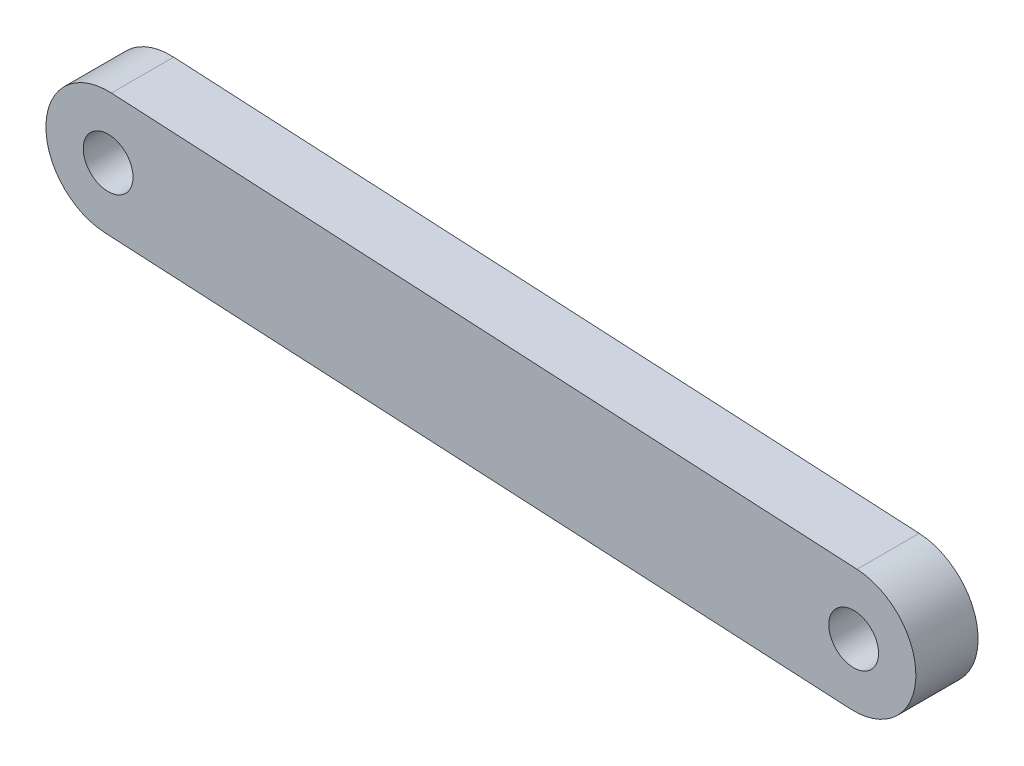
ISO-10303-21;
HEADER;
FILE_DESCRIPTION(('STEP AP214'),'2;1');
FILE_NAME('part.step','',(''),(''),'','','');
FILE_SCHEMA(('AUTOMOTIVE_DESIGN { 1 0 10303 214 1 1 1 1 }'));
ENDSEC;
DATA;
#1=APPLICATION_CONTEXT('core data for automotive mechanical design processes');
#2=APPLICATION_PROTOCOL_DEFINITION('international standard','automotive_design',2000,#1);
#3=PRODUCT_CONTEXT('',#1,'mechanical');
#4=PRODUCT('Part','Part','',(#3));
#5=PRODUCT_RELATED_PRODUCT_CATEGORY('part','',(#4));
#6=PRODUCT_DEFINITION_FORMATION('','',#4);
#7=PRODUCT_DEFINITION_CONTEXT('part definition',#1,'design');
#8=PRODUCT_DEFINITION('design','',#6,#7);
#9=PRODUCT_DEFINITION_SHAPE('','',#8);
#10=(LENGTH_UNIT() NAMED_UNIT(*) SI_UNIT(.MILLI.,.METRE.));
#11=(NAMED_UNIT(*) PLANE_ANGLE_UNIT() SI_UNIT($,.RADIAN.));
#12=(NAMED_UNIT(*) SI_UNIT($,.STERADIAN.) SOLID_ANGLE_UNIT());
#13=UNCERTAINTY_MEASURE_WITH_UNIT(LENGTH_MEASURE(1.E-05),#10,'distance_accuracy_value','');
#14=(GEOMETRIC_REPRESENTATION_CONTEXT(3) GLOBAL_UNCERTAINTY_ASSIGNED_CONTEXT((#13)) GLOBAL_UNIT_ASSIGNED_CONTEXT((#10,
#11,#12)) REPRESENTATION_CONTEXT('',''));
#15=CARTESIAN_POINT('',(0.,0.,0.));
#16=DIRECTION('',(0.,0.,1.));
#17=DIRECTION('',(1.,0.,0.));
#18=AXIS2_PLACEMENT_3D('',#15,#16,#17);
#19=CARTESIAN_POINT('',(-35.5373266073171,-8.81247047670461,-5.));
#20=DIRECTION('',(0.,0.,-1.));
#21=DIRECTION('',(0.,-1.,0.));
#22=AXIS2_PLACEMENT_3D('',#19,#20,#21);
#23=PLANE('',#22);
#24=CARTESIAN_POINT('',(-35.5373266073171,-8.81247047670461,-5.));
#25=DIRECTION('',(0.,0.,1.));
#26=DIRECTION('',(0.,-1.,0.));
#27=AXIS2_PLACEMENT_3D('',#24,#25,#26);
#28=CIRCLE('',#27,2.);
#29=CARTESIAN_POINT('',(-35.5373266073171,-10.8124704767046,-5.));
#30=VERTEX_POINT('',#29);
#31=EDGE_CURVE('E103',#30,#30,#28,.T.);
#32=ORIENTED_EDGE('',*,*,#31,.T.);
#33=EDGE_LOOP('',(#32));
#34=FACE_BOUND('',#33,.T.);
#35=CARTESIAN_POINT('',(-35.5373266073171,-8.81247047670461,-5.));
#36=DIRECTION('',(0.,0.,1.));
#37=DIRECTION('',(0.,-1.,0.));
#38=AXIS2_PLACEMENT_3D('',#35,#36,#37);
#39=CIRCLE('',#38,5.);
#40=CARTESIAN_POINT('',(-35.802717202182,-13.8054222922299,-5.));
#41=VERTEX_POINT('',#40);
#42=CARTESIAN_POINT('',(-35.2719360124522,-3.81951866117932,-5.));
#43=VERTEX_POINT('',#42);
#44=EDGE_CURVE('E91',#41,#43,#39,.T.);
#45=ORIENTED_EDGE('',*,*,#44,.F.);
#46=DIRECTION('',(0.998590363105057,-0.053078118972978,0.));
#47=VECTOR('',#46,1.);
#48=CARTESIAN_POINT('',(-35.802717202182,-13.8054222922299,-5.));
#49=LINE('',#48,#47);
#50=CARTESIAN_POINT('',(-95.7181389884854,-10.6207351538512,-5.));
#51=VERTEX_POINT('',#50);
#52=EDGE_CURVE('E94',#51,#41,#49,.T.);
#53=ORIENTED_EDGE('',*,*,#52,.F.);
#54=CARTESIAN_POINT('',(-95.4527483936205,-5.62778333832594,-5.));
#55=DIRECTION('',(0.,0.,1.));
#56=DIRECTION('',(0.,1.,0.));
#57=AXIS2_PLACEMENT_3D('',#54,#55,#56);
#58=CIRCLE('',#57,4.99999999999999);
#59=CARTESIAN_POINT('',(-95.1873577987556,-0.634831522800653,-5.));
#60=VERTEX_POINT('',#59);
#61=EDGE_CURVE('E82',#60,#51,#58,.T.);
#62=ORIENTED_EDGE('',*,*,#61,.F.);
#63=DIRECTION('',(-0.998590363105057,0.0530781189729777,0.));
#64=VECTOR('',#63,1.);
#65=CARTESIAN_POINT('',(-35.2719360124522,-3.81951866117932,-5.));
#66=LINE('',#65,#64);
#67=EDGE_CURVE('E87',#43,#60,#66,.T.);
#68=ORIENTED_EDGE('',*,*,#67,.F.);
#69=EDGE_LOOP('',(#45,#53,#62,#68));
#70=FACE_BOUND('',#69,.T.);
#71=CARTESIAN_POINT('',(-95.4527483936205,-5.62778333832594,-5.));
#72=DIRECTION('',(0.,0.,1.));
#73=DIRECTION('',(0.,-1.,0.));
#74=AXIS2_PLACEMENT_3D('',#71,#72,#73);
#75=CIRCLE('',#74,2.);
#76=CARTESIAN_POINT('',(-95.4527483936205,-7.62778333832594,-5.));
#77=VERTEX_POINT('',#76);
#78=EDGE_CURVE('E114',#77,#77,#75,.T.);
#79=ORIENTED_EDGE('',*,*,#78,.T.);
#80=EDGE_LOOP('',(#79));
#81=FACE_BOUND('',#80,.T.);
#82=ADVANCED_FACE('F35',(#34,#70,#81),#23,.T.);
#83=CARTESIAN_POINT('',(-35.5373266073171,-8.81247047670461,0.));
#84=DIRECTION('',(0.,0.,-1.));
#85=DIRECTION('',(0.,-1.,0.));
#86=AXIS2_PLACEMENT_3D('',#83,#84,#85);
#87=PLANE('',#86);
#88=CARTESIAN_POINT('',(-35.5373266073171,-8.81247047670461,0.));
#89=DIRECTION('',(0.,0.,1.));
#90=DIRECTION('',(0.,-1.,0.));
#91=AXIS2_PLACEMENT_3D('',#88,#89,#90);
#92=CIRCLE('',#91,5.);
#93=CARTESIAN_POINT('',(-35.802717202182,-13.8054222922299,0.));
#94=VERTEX_POINT('',#93);
#95=CARTESIAN_POINT('',(-35.2719360124522,-3.81951866117932,0.));
#96=VERTEX_POINT('',#95);
#97=EDGE_CURVE('E99',#94,#96,#92,.T.);
#98=ORIENTED_EDGE('',*,*,#97,.T.);
#99=DIRECTION('',(-0.998590363105057,0.0530781189729777,0.));
#100=VECTOR('',#99,1.);
#101=CARTESIAN_POINT('',(-35.2719360124522,-3.81951866117932,0.));
#102=LINE('',#101,#100);
#103=CARTESIAN_POINT('',(-95.1873577987556,-0.634831522800652,0.));
#104=VERTEX_POINT('',#103);
#105=EDGE_CURVE('E102',#96,#104,#102,.T.);
#106=ORIENTED_EDGE('',*,*,#105,.T.);
#107=CARTESIAN_POINT('',(-95.4527483936205,-5.62778333832593,0.));
#108=DIRECTION('',(0.,0.,1.));
#109=DIRECTION('',(0.,1.,0.));
#110=AXIS2_PLACEMENT_3D('',#107,#108,#109);
#111=CIRCLE('',#110,4.99999999999999);
#112=CARTESIAN_POINT('',(-95.7181389884854,-10.6207351538512,0.));
#113=VERTEX_POINT('',#112);
#114=EDGE_CURVE('E85',#104,#113,#111,.T.);
#115=ORIENTED_EDGE('',*,*,#114,.T.);
#116=DIRECTION('',(0.998590363105057,-0.053078118972978,0.));
#117=VECTOR('',#116,1.);
#118=CARTESIAN_POINT('',(-35.802717202182,-13.8054222922299,0.));
#119=LINE('',#118,#117);
#120=EDGE_CURVE('E106',#113,#94,#119,.T.);
#121=ORIENTED_EDGE('',*,*,#120,.T.);
#122=EDGE_LOOP('',(#98,#106,#115,#121));
#123=FACE_BOUND('',#122,.T.);
#124=CARTESIAN_POINT('',(-35.5373266073171,-8.81247047670461,0.));
#125=DIRECTION('',(0.,0.,1.));
#126=DIRECTION('',(0.,-1.,0.));
#127=AXIS2_PLACEMENT_3D('',#124,#125,#126);
#128=CIRCLE('',#127,2.);
#129=CARTESIAN_POINT('',(-35.5373266073171,-10.8124704767046,0.));
#130=VERTEX_POINT('',#129);
#131=EDGE_CURVE('E111',#130,#130,#128,.T.);
#132=ORIENTED_EDGE('',*,*,#131,.F.);
#133=EDGE_LOOP('',(#132));
#134=FACE_BOUND('',#133,.T.);
#135=CARTESIAN_POINT('',(-95.4527483936205,-5.62778333832593,0.));
#136=DIRECTION('',(0.,0.,1.));
#137=DIRECTION('',(0.,-1.,0.));
#138=AXIS2_PLACEMENT_3D('',#135,#136,#137);
#139=CIRCLE('',#138,2.);
#140=CARTESIAN_POINT('',(-95.4527483936205,-7.62778333832594,0.));
#141=VERTEX_POINT('',#140);
#142=EDGE_CURVE('E117',#141,#141,#139,.T.);
#143=ORIENTED_EDGE('',*,*,#142,.F.);
#144=EDGE_LOOP('',(#143));
#145=FACE_BOUND('',#144,.T.);
#146=ADVANCED_FACE('F130',(#123,#134,#145),#87,.F.);
#147=CARTESIAN_POINT('',(-35.5373266073171,-8.81247047670461,-5.));
#148=DIRECTION('',(0.,0.,1.));
#149=DIRECTION('',(0.,1.,0.));
#150=AXIS2_PLACEMENT_3D('',#147,#148,#149);
#151=CYLINDRICAL_SURFACE('',#150,5.);
#152=ORIENTED_EDGE('',*,*,#97,.F.);
#153=DIRECTION('',(0.,0.,1.));
#154=VECTOR('',#153,1.);
#155=CARTESIAN_POINT('',(-35.802717202182,-13.8054222922299,-5.));
#156=LINE('',#155,#154);
#157=EDGE_CURVE('E52',#41,#94,#156,.T.);
#158=ORIENTED_EDGE('',*,*,#157,.F.);
#159=ORIENTED_EDGE('',*,*,#44,.T.);
#160=DIRECTION('',(0.,0.,1.));
#161=VECTOR('',#160,1.);
#162=CARTESIAN_POINT('',(-35.2719360124522,-3.81951866117932,-5.));
#163=LINE('',#162,#161);
#164=EDGE_CURVE('E11',#43,#96,#163,.T.);
#165=ORIENTED_EDGE('',*,*,#164,.T.);
#166=EDGE_LOOP('',(#152,#158,#159,#165));
#167=FACE_BOUND('',#166,.T.);
#168=ADVANCED_FACE('F37',(#167),#151,.T.);
#169=CARTESIAN_POINT('',(-35.2719360124522,-3.81951866117932,-5.));
#170=DIRECTION('',(-0.0530781189729777,-0.998590363105058,0.));
#171=DIRECTION('',(0.998590363105058,-0.0530781189729777,0.));
#172=AXIS2_PLACEMENT_3D('',#169,#170,#171);
#173=PLANE('',#172);
#174=ORIENTED_EDGE('',*,*,#105,.F.);
#175=ORIENTED_EDGE('',*,*,#164,.F.);
#176=ORIENTED_EDGE('',*,*,#67,.T.);
#177=DIRECTION('',(0.,0.,1.));
#178=VECTOR('',#177,1.);
#179=CARTESIAN_POINT('',(-95.1873577987556,-0.634831522800653,-5.));
#180=LINE('',#179,#178);
#181=EDGE_CURVE('E44',#60,#104,#180,.T.);
#182=ORIENTED_EDGE('',*,*,#181,.T.);
#183=EDGE_LOOP('',(#174,#175,#176,#182));
#184=FACE_BOUND('',#183,.T.);
#185=ADVANCED_FACE('F88',(#184),#173,.F.);
#186=CARTESIAN_POINT('',(-95.4527483936205,-5.62778333832594,-5.));
#187=DIRECTION('',(0.,0.,1.));
#188=DIRECTION('',(0.,1.,0.));
#189=AXIS2_PLACEMENT_3D('',#186,#187,#188);
#190=CYLINDRICAL_SURFACE('',#189,4.99999999999999);
#191=ORIENTED_EDGE('',*,*,#114,.F.);
#192=ORIENTED_EDGE('',*,*,#181,.F.);
#193=ORIENTED_EDGE('',*,*,#61,.T.);
#194=DIRECTION('',(0.,0.,1.));
#195=VECTOR('',#194,1.);
#196=CARTESIAN_POINT('',(-95.7181389884854,-10.6207351538512,-5.));
#197=LINE('',#196,#195);
#198=EDGE_CURVE('E68',#51,#113,#197,.T.);
#199=ORIENTED_EDGE('',*,*,#198,.T.);
#200=EDGE_LOOP('',(#191,#192,#193,#199));
#201=FACE_BOUND('',#200,.T.);
#202=ADVANCED_FACE('F80',(#201),#190,.T.);
#203=CARTESIAN_POINT('',(-35.802717202182,-13.8054222922299,-5.));
#204=DIRECTION('',(0.053078118972978,0.998590363105057,0.));
#205=DIRECTION('',(-0.998590363105058,0.053078118972978,0.));
#206=AXIS2_PLACEMENT_3D('',#203,#204,#205);
#207=PLANE('',#206);
#208=ORIENTED_EDGE('',*,*,#120,.F.);
#209=ORIENTED_EDGE('',*,*,#198,.F.);
#210=ORIENTED_EDGE('',*,*,#52,.T.);
#211=ORIENTED_EDGE('',*,*,#157,.T.);
#212=EDGE_LOOP('',(#208,#209,#210,#211));
#213=FACE_BOUND('',#212,.T.);
#214=ADVANCED_FACE('F142',(#213),#207,.F.);
#215=CARTESIAN_POINT('',(-35.5373266073171,-8.81247047670461,-5.));
#216=DIRECTION('',(0.,0.,1.));
#217=DIRECTION('',(0.,1.,0.));
#218=AXIS2_PLACEMENT_3D('',#215,#216,#217);
#219=CYLINDRICAL_SURFACE('',#218,2.);
#220=ORIENTED_EDGE('',*,*,#31,.F.);
#221=EDGE_LOOP('',(#220));
#222=FACE_BOUND('',#221,.T.);
#223=ORIENTED_EDGE('',*,*,#131,.T.);
#224=EDGE_LOOP('',(#223));
#225=FACE_BOUND('',#224,.T.);
#226=ADVANCED_FACE('F126',(#222,#225),#219,.F.);
#227=CARTESIAN_POINT('',(-95.4527483936205,-5.62778333832594,-5.));
#228=DIRECTION('',(0.,0.,1.));
#229=DIRECTION('',(0.,1.,0.));
#230=AXIS2_PLACEMENT_3D('',#227,#228,#229);
#231=CYLINDRICAL_SURFACE('',#230,2.);
#232=ORIENTED_EDGE('',*,*,#78,.F.);
#233=EDGE_LOOP('',(#232));
#234=FACE_BOUND('',#233,.T.);
#235=ORIENTED_EDGE('',*,*,#142,.T.);
#236=EDGE_LOOP('',(#235));
#237=FACE_BOUND('',#236,.T.);
#238=ADVANCED_FACE('F123',(#234,#237),#231,.F.);
#239=CLOSED_SHELL('',(#82,#146,#168,#185,#202,#214,#226,#238));
#240=MANIFOLD_SOLID_BREP('B2',#239);
#241=ADVANCED_BREP_SHAPE_REPRESENTATION('',(#18,#240),#14);
#242=SHAPE_DEFINITION_REPRESENTATION(#9,#241);
ENDSEC;
END-ISO-10303-21;
